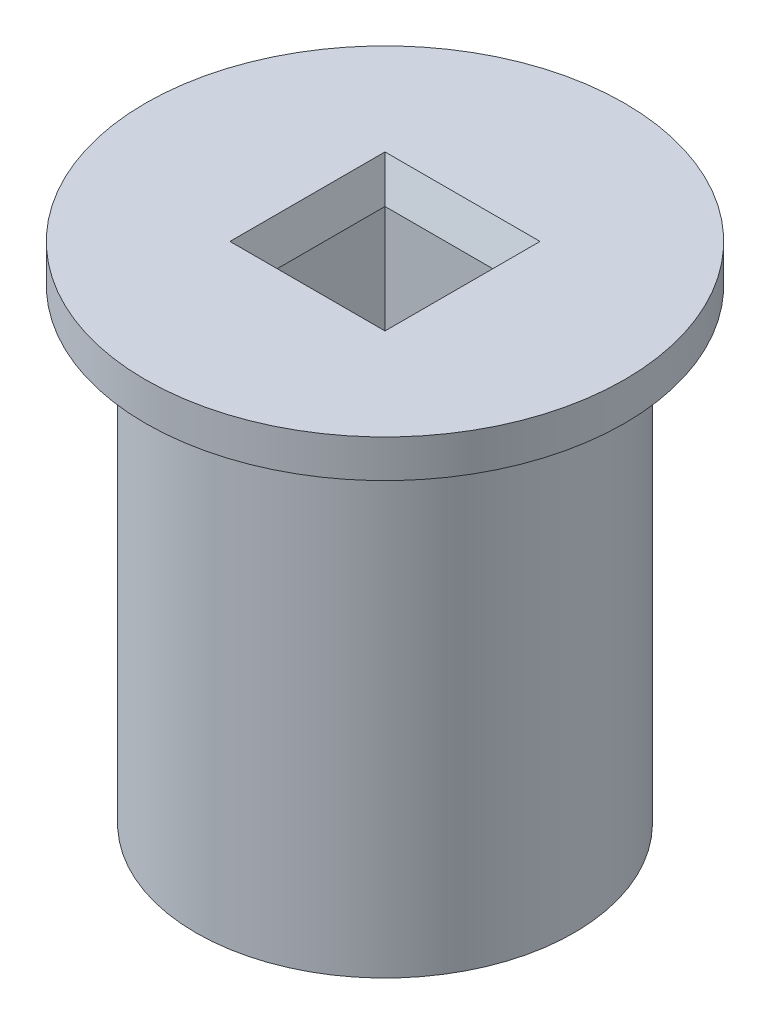
ISO-10303-21;
HEADER;
FILE_DESCRIPTION(('STEP AP214'),'2;1');
FILE_NAME('part.step','',(''),(''),'','','');
FILE_SCHEMA(('AUTOMOTIVE_DESIGN { 1 0 10303 214 1 1 1 1 }'));
ENDSEC;
DATA;
#1=APPLICATION_CONTEXT('core data for automotive mechanical design processes');
#2=APPLICATION_PROTOCOL_DEFINITION('international standard','automotive_design',2000,#1);
#3=PRODUCT_CONTEXT('',#1,'mechanical');
#4=PRODUCT('Part','Part','',(#3));
#5=PRODUCT_RELATED_PRODUCT_CATEGORY('part','',(#4));
#6=PRODUCT_DEFINITION_FORMATION('','',#4);
#7=PRODUCT_DEFINITION_CONTEXT('part definition',#1,'design');
#8=PRODUCT_DEFINITION('design','',#6,#7);
#9=PRODUCT_DEFINITION_SHAPE('','',#8);
#10=(LENGTH_UNIT() NAMED_UNIT(*) SI_UNIT(.MILLI.,.METRE.));
#11=(NAMED_UNIT(*) PLANE_ANGLE_UNIT() SI_UNIT($,.RADIAN.));
#12=(NAMED_UNIT(*) SI_UNIT($,.STERADIAN.) SOLID_ANGLE_UNIT());
#13=UNCERTAINTY_MEASURE_WITH_UNIT(LENGTH_MEASURE(1.E-05),#10,'distance_accuracy_value','');
#14=(GEOMETRIC_REPRESENTATION_CONTEXT(3) GLOBAL_UNCERTAINTY_ASSIGNED_CONTEXT((#13)) GLOBAL_UNIT_ASSIGNED_CONTEXT((#10,
#11,#12)) REPRESENTATION_CONTEXT('',''));
#15=CARTESIAN_POINT('',(0.,0.,0.));
#16=DIRECTION('',(0.,0.,1.));
#17=DIRECTION('',(1.,0.,0.));
#18=AXIS2_PLACEMENT_3D('',#15,#16,#17);
#19=CARTESIAN_POINT('',(0.,40.,0.));
#20=DIRECTION('',(0.,-1.,0.));
#21=DIRECTION('',(0.,0.,-1.));
#22=AXIS2_PLACEMENT_3D('',#19,#20,#21);
#23=CYLINDRICAL_SURFACE('',#22,15.);
#24=CARTESIAN_POINT('',(0.,0.,0.));
#25=DIRECTION('',(0.,1.,0.));
#26=DIRECTION('',(0.,0.,1.));
#27=AXIS2_PLACEMENT_3D('',#24,#25,#26);
#28=CIRCLE('',#27,15.);
#29=CARTESIAN_POINT('',(0.,0.,15.));
#30=VERTEX_POINT('',#29);
#31=EDGE_CURVE('E92',#30,#30,#28,.T.);
#32=ORIENTED_EDGE('',*,*,#31,.T.);
#33=EDGE_LOOP('',(#32));
#34=FACE_BOUND('',#33,.T.);
#35=CARTESIAN_POINT('',(0.,37.,0.));
#36=DIRECTION('',(0.,1.,0.));
#37=DIRECTION('',(0.,0.,1.));
#38=AXIS2_PLACEMENT_3D('',#35,#36,#37);
#39=CIRCLE('',#38,15.);
#40=CARTESIAN_POINT('',(0.,37.,15.));
#41=VERTEX_POINT('',#40);
#42=EDGE_CURVE('E113',#41,#41,#39,.T.);
#43=ORIENTED_EDGE('',*,*,#42,.F.);
#44=EDGE_LOOP('',(#43));
#45=FACE_BOUND('',#44,.T.);
#46=ADVANCED_FACE('F33',(#34,#45),#23,.T.);
#47=CARTESIAN_POINT('',(0.,40.,0.));
#48=DIRECTION('',(0.,1.,0.));
#49=DIRECTION('',(0.,0.,1.));
#50=AXIS2_PLACEMENT_3D('',#47,#48,#49);
#51=PLANE('',#50);
#52=DIRECTION('',(1.,0.,0.));
#53=VECTOR('',#52,1.);
#54=CARTESIAN_POINT('',(0.,40.,-6.15000000000001));
#55=LINE('',#54,#53);
#56=CARTESIAN_POINT('',(-6.15000000000001,40.,-6.15000000000001));
#57=VERTEX_POINT('',#56);
#58=CARTESIAN_POINT('',(6.15000000000001,40.,-6.15000000000001));
#59=VERTEX_POINT('',#58);
#60=EDGE_CURVE('E128',#57,#59,#55,.T.);
#61=ORIENTED_EDGE('',*,*,#60,.T.);
#62=DIRECTION('',(0.,0.,1.));
#63=VECTOR('',#62,1.);
#64=CARTESIAN_POINT('',(6.15000000000001,40.,0.));
#65=LINE('',#64,#63);
#66=CARTESIAN_POINT('',(6.15000000000001,40.,6.15000000000001));
#67=VERTEX_POINT('',#66);
#68=EDGE_CURVE('E134',#59,#67,#65,.T.);
#69=ORIENTED_EDGE('',*,*,#68,.T.);
#70=DIRECTION('',(-1.,0.,0.));
#71=VECTOR('',#70,1.);
#72=CARTESIAN_POINT('',(0.,40.,6.15000000000001));
#73=LINE('',#72,#71);
#74=CARTESIAN_POINT('',(-6.15000000000001,40.,6.15000000000001));
#75=VERTEX_POINT('',#74);
#76=EDGE_CURVE('E132',#67,#75,#73,.T.);
#77=ORIENTED_EDGE('',*,*,#76,.T.);
#78=DIRECTION('',(0.,0.,-1.));
#79=VECTOR('',#78,1.);
#80=CARTESIAN_POINT('',(-6.15000000000001,40.,0.));
#81=LINE('',#80,#79);
#82=EDGE_CURVE('E130',#75,#57,#81,.T.);
#83=ORIENTED_EDGE('',*,*,#82,.T.);
#84=EDGE_LOOP('',(#61,#69,#77,#83));
#85=FACE_BOUND('',#84,.T.);
#86=CARTESIAN_POINT('',(0.,40.,0.));
#87=DIRECTION('',(0.,1.,0.));
#88=DIRECTION('',(0.,0.,1.));
#89=AXIS2_PLACEMENT_3D('',#86,#87,#88);
#90=CIRCLE('',#89,19.);
#91=CARTESIAN_POINT('',(0.,40.,19.));
#92=VERTEX_POINT('',#91);
#93=EDGE_CURVE('E110',#92,#92,#90,.T.);
#94=ORIENTED_EDGE('',*,*,#93,.T.);
#95=EDGE_LOOP('',(#94));
#96=FACE_BOUND('',#95,.T.);
#97=ADVANCED_FACE('F155',(#85,#96),#51,.T.);
#98=CARTESIAN_POINT('',(0.,0.,0.));
#99=DIRECTION('',(0.,1.,0.));
#100=DIRECTION('',(0.,0.,1.));
#101=AXIS2_PLACEMENT_3D('',#98,#99,#100);
#102=PLANE('',#101);
#103=ORIENTED_EDGE('',*,*,#31,.F.);
#104=EDGE_LOOP('',(#103));
#105=FACE_BOUND('',#104,.T.);
#106=DIRECTION('',(0.,0.,1.));
#107=VECTOR('',#106,1.);
#108=CARTESIAN_POINT('',(-5.15,0.,5.15));
#109=LINE('',#108,#107);
#110=CARTESIAN_POINT('',(-5.15,0.,-5.15));
#111=VERTEX_POINT('',#110);
#112=CARTESIAN_POINT('',(-5.15,0.,5.15));
#113=VERTEX_POINT('',#112);
#114=EDGE_CURVE('E88',#111,#113,#109,.T.);
#115=ORIENTED_EDGE('',*,*,#114,.T.);
#116=DIRECTION('',(1.,0.,0.));
#117=VECTOR('',#116,1.);
#118=CARTESIAN_POINT('',(5.15,0.,5.15));
#119=LINE('',#118,#117);
#120=CARTESIAN_POINT('',(5.15,0.,5.15));
#121=VERTEX_POINT('',#120);
#122=EDGE_CURVE('E96',#113,#121,#119,.T.);
#123=ORIENTED_EDGE('',*,*,#122,.T.);
#124=DIRECTION('',(0.,0.,-1.));
#125=VECTOR('',#124,1.);
#126=CARTESIAN_POINT('',(5.15,0.,5.15));
#127=LINE('',#126,#125);
#128=CARTESIAN_POINT('',(5.15,0.,-5.15));
#129=VERTEX_POINT('',#128);
#130=EDGE_CURVE('E102',#121,#129,#127,.T.);
#131=ORIENTED_EDGE('',*,*,#130,.T.);
#132=DIRECTION('',(-1.,0.,0.));
#133=VECTOR('',#132,1.);
#134=CARTESIAN_POINT('',(5.15,0.,-5.15));
#135=LINE('',#134,#133);
#136=EDGE_CURVE('E106',#129,#111,#135,.T.);
#137=ORIENTED_EDGE('',*,*,#136,.T.);
#138=EDGE_LOOP('',(#115,#123,#131,#137));
#139=FACE_BOUND('',#138,.T.);
#140=ADVANCED_FACE('F104',(#105,#139),#102,.F.);
#141=CARTESIAN_POINT('',(-5.15,40.,5.15));
#142=DIRECTION('',(1.,0.,0.));
#143=DIRECTION('',(0.,0.,-1.));
#144=AXIS2_PLACEMENT_3D('',#141,#142,#143);
#145=PLANE('',#144);
#146=DIRECTION('',(0.,-1.,0.));
#147=VECTOR('',#146,1.);
#148=CARTESIAN_POINT('',(-5.15,40.,-5.15));
#149=LINE('',#148,#147);
#150=CARTESIAN_POINT('',(-5.15,37.2525225805454,-5.15));
#151=VERTEX_POINT('',#150);
#152=EDGE_CURVE('E118',#151,#111,#149,.T.);
#153=ORIENTED_EDGE('',*,*,#152,.F.);
#154=DIRECTION('',(0.,0.,1.));
#155=VECTOR('',#154,1.);
#156=CARTESIAN_POINT('',(-5.15,37.2525225805454,5.15));
#157=LINE('',#156,#155);
#158=CARTESIAN_POINT('',(-5.15,37.2525225805454,5.15));
#159=VERTEX_POINT('',#158);
#160=EDGE_CURVE('E42',#151,#159,#157,.T.);
#161=ORIENTED_EDGE('',*,*,#160,.T.);
#162=DIRECTION('',(0.,-1.,0.));
#163=VECTOR('',#162,1.);
#164=CARTESIAN_POINT('',(-5.15,40.,5.15));
#165=LINE('',#164,#163);
#166=EDGE_CURVE('E84',#159,#113,#165,.T.);
#167=ORIENTED_EDGE('',*,*,#166,.T.);
#168=ORIENTED_EDGE('',*,*,#114,.F.);
#169=EDGE_LOOP('',(#153,#161,#167,#168));
#170=FACE_BOUND('',#169,.T.);
#171=ADVANCED_FACE('F86',(#170),#145,.T.);
#172=CARTESIAN_POINT('',(5.15,40.,5.15));
#173=DIRECTION('',(0.,0.,-1.));
#174=DIRECTION('',(-1.,0.,0.));
#175=AXIS2_PLACEMENT_3D('',#172,#173,#174);
#176=PLANE('',#175);
#177=ORIENTED_EDGE('',*,*,#166,.F.);
#178=DIRECTION('',(1.,0.,0.));
#179=VECTOR('',#178,1.);
#180=CARTESIAN_POINT('',(5.15,37.2525225805454,5.15));
#181=LINE('',#180,#179);
#182=CARTESIAN_POINT('',(5.15,37.2525225805454,5.15));
#183=VERTEX_POINT('',#182);
#184=EDGE_CURVE('E137',#159,#183,#181,.T.);
#185=ORIENTED_EDGE('',*,*,#184,.T.);
#186=DIRECTION('',(0.,-1.,0.));
#187=VECTOR('',#186,1.);
#188=CARTESIAN_POINT('',(5.15,40.,5.15));
#189=LINE('',#188,#187);
#190=EDGE_CURVE('E93',#183,#121,#189,.T.);
#191=ORIENTED_EDGE('',*,*,#190,.T.);
#192=ORIENTED_EDGE('',*,*,#122,.F.);
#193=EDGE_LOOP('',(#177,#185,#191,#192));
#194=FACE_BOUND('',#193,.T.);
#195=ADVANCED_FACE('F97',(#194),#176,.T.);
#196=CARTESIAN_POINT('',(5.15,40.,5.15));
#197=DIRECTION('',(-1.,0.,0.));
#198=DIRECTION('',(0.,0.,1.));
#199=AXIS2_PLACEMENT_3D('',#196,#197,#198);
#200=PLANE('',#199);
#201=ORIENTED_EDGE('',*,*,#190,.F.);
#202=DIRECTION('',(0.,0.,-1.));
#203=VECTOR('',#202,1.);
#204=CARTESIAN_POINT('',(5.15,37.2525225805454,5.15));
#205=LINE('',#204,#203);
#206=CARTESIAN_POINT('',(5.15,37.2525225805454,-5.15));
#207=VERTEX_POINT('',#206);
#208=EDGE_CURVE('E125',#183,#207,#205,.T.);
#209=ORIENTED_EDGE('',*,*,#208,.T.);
#210=DIRECTION('',(0.,-1.,0.));
#211=VECTOR('',#210,1.);
#212=CARTESIAN_POINT('',(5.15,40.,-5.15));
#213=LINE('',#212,#211);
#214=EDGE_CURVE('E120',#207,#129,#213,.T.);
#215=ORIENTED_EDGE('',*,*,#214,.T.);
#216=ORIENTED_EDGE('',*,*,#130,.F.);
#217=EDGE_LOOP('',(#201,#209,#215,#216));
#218=FACE_BOUND('',#217,.T.);
#219=ADVANCED_FACE('F244',(#218),#200,.T.);
#220=CARTESIAN_POINT('',(5.15,40.,-5.15));
#221=DIRECTION('',(0.,0.,1.));
#222=DIRECTION('',(1.,0.,0.));
#223=AXIS2_PLACEMENT_3D('',#220,#221,#222);
#224=PLANE('',#223);
#225=ORIENTED_EDGE('',*,*,#214,.F.);
#226=DIRECTION('',(-1.,0.,0.));
#227=VECTOR('',#226,1.);
#228=CARTESIAN_POINT('',(5.15,37.2525225805454,-5.15));
#229=LINE('',#228,#227);
#230=EDGE_CURVE('E11',#207,#151,#229,.T.);
#231=ORIENTED_EDGE('',*,*,#230,.T.);
#232=ORIENTED_EDGE('',*,*,#152,.T.);
#233=ORIENTED_EDGE('',*,*,#136,.F.);
#234=EDGE_LOOP('',(#225,#231,#232,#233));
#235=FACE_BOUND('',#234,.T.);
#236=ADVANCED_FACE('F168',(#235),#224,.T.);
#237=CARTESIAN_POINT('',(0.,37.,0.));
#238=DIRECTION('',(0.,1.,0.));
#239=DIRECTION('',(0.,0.,1.));
#240=AXIS2_PLACEMENT_3D('',#237,#238,#239);
#241=PLANE('',#240);
#242=CARTESIAN_POINT('',(0.,37.,0.));
#243=DIRECTION('',(0.,1.,0.));
#244=DIRECTION('',(0.,0.,1.));
#245=AXIS2_PLACEMENT_3D('',#242,#243,#244);
#246=CIRCLE('',#245,19.);
#247=CARTESIAN_POINT('',(0.,37.,19.));
#248=VERTEX_POINT('',#247);
#249=EDGE_CURVE('E107',#248,#248,#246,.T.);
#250=ORIENTED_EDGE('',*,*,#249,.F.);
#251=EDGE_LOOP('',(#250));
#252=FACE_BOUND('',#251,.T.);
#253=ORIENTED_EDGE('',*,*,#42,.T.);
#254=EDGE_LOOP('',(#253));
#255=FACE_BOUND('',#254,.T.);
#256=ADVANCED_FACE('F159',(#252,#255),#241,.F.);
#257=CARTESIAN_POINT('',(0.,37.,0.));
#258=DIRECTION('',(0.,1.,0.));
#259=DIRECTION('',(0.,0.,1.));
#260=AXIS2_PLACEMENT_3D('',#257,#258,#259);
#261=CYLINDRICAL_SURFACE('',#260,19.);
#262=ORIENTED_EDGE('',*,*,#249,.T.);
#263=EDGE_LOOP('',(#262));
#264=FACE_BOUND('',#263,.T.);
#265=ORIENTED_EDGE('',*,*,#93,.F.);
#266=EDGE_LOOP('',(#265));
#267=FACE_BOUND('',#266,.T.);
#268=ADVANCED_FACE('F157',(#264,#267),#261,.T.);
#269=CARTESIAN_POINT('',(-5.15,37.2525225805454,5.15));
#270=DIRECTION('',(-0.939692620785907,-0.342020143325673,0.));
#271=DIRECTION('',(0.,0.,1.));
#272=AXIS2_PLACEMENT_3D('',#269,#270,#271);
#273=PLANE('',#272);
#274=DIRECTION('',(0.323615577118188,-0.889126490715986,0.323615577118188));
#275=VECTOR('',#274,1.);
#276=CARTESIAN_POINT('',(-4.07131146993856,34.2888502015769,-4.07131146993856));
#277=LINE('',#276,#275);
#278=EDGE_CURVE('E143',#57,#151,#277,.T.);
#279=ORIENTED_EDGE('',*,*,#278,.F.);
#280=ORIENTED_EDGE('',*,*,#82,.F.);
#281=DIRECTION('',(0.323615577118188,-0.889126490715986,-0.323615577118188));
#282=VECTOR('',#281,1.);
#283=CARTESIAN_POINT('',(-4.07131146993856,34.2888502015769,4.07131146993856));
#284=LINE('',#283,#282);
#285=EDGE_CURVE('E37',#159,#75,#284,.F.);
#286=ORIENTED_EDGE('',*,*,#285,.F.);
#287=ORIENTED_EDGE('',*,*,#160,.F.);
#288=EDGE_LOOP('',(#279,#280,#286,#287));
#289=FACE_BOUND('',#288,.T.);
#290=ADVANCED_FACE('F35',(#289),#273,.F.);
#291=CARTESIAN_POINT('',(5.15,37.2525225805454,5.15));
#292=DIRECTION('',(0.,-0.342020143325673,0.939692620785907));
#293=DIRECTION('',(1.,0.,0.));
#294=AXIS2_PLACEMENT_3D('',#291,#292,#293);
#295=PLANE('',#294);
#296=ORIENTED_EDGE('',*,*,#285,.T.);
#297=ORIENTED_EDGE('',*,*,#76,.F.);
#298=DIRECTION('',(-0.323615577118188,-0.889126490715986,-0.323615577118188));
#299=VECTOR('',#298,1.);
#300=CARTESIAN_POINT('',(5.15,37.2525225805454,5.15));
#301=LINE('',#300,#299);
#302=EDGE_CURVE('E142',#183,#67,#301,.F.);
#303=ORIENTED_EDGE('',*,*,#302,.F.);
#304=ORIENTED_EDGE('',*,*,#184,.F.);
#305=EDGE_LOOP('',(#296,#297,#303,#304));
#306=FACE_BOUND('',#305,.T.);
#307=ADVANCED_FACE('F166',(#306),#295,.F.);
#308=CARTESIAN_POINT('',(5.15,37.2525225805454,-5.15));
#309=DIRECTION('',(0.,-0.342020143325673,-0.939692620785907));
#310=DIRECTION('',(-1.,0.,0.));
#311=AXIS2_PLACEMENT_3D('',#308,#309,#310);
#312=PLANE('',#311);
#313=ORIENTED_EDGE('',*,*,#278,.T.);
#314=ORIENTED_EDGE('',*,*,#230,.F.);
#315=DIRECTION('',(0.323615577118188,0.889126490715986,-0.323615577118188));
#316=VECTOR('',#315,1.);
#317=CARTESIAN_POINT('',(4.07131146993856,34.2888502015769,-4.07131146993856));
#318=LINE('',#317,#316);
#319=EDGE_CURVE('E140',#59,#207,#318,.F.);
#320=ORIENTED_EDGE('',*,*,#319,.F.);
#321=ORIENTED_EDGE('',*,*,#60,.F.);
#322=EDGE_LOOP('',(#313,#314,#320,#321));
#323=FACE_BOUND('',#322,.T.);
#324=ADVANCED_FACE('F186',(#323),#312,.F.);
#325=CARTESIAN_POINT('',(5.15,37.2525225805454,5.15));
#326=DIRECTION('',(0.939692620785907,-0.342020143325673,0.));
#327=DIRECTION('',(0.,0.,-1.));
#328=AXIS2_PLACEMENT_3D('',#325,#326,#327);
#329=PLANE('',#328);
#330=ORIENTED_EDGE('',*,*,#302,.T.);
#331=ORIENTED_EDGE('',*,*,#68,.F.);
#332=ORIENTED_EDGE('',*,*,#319,.T.);
#333=ORIENTED_EDGE('',*,*,#208,.F.);
#334=EDGE_LOOP('',(#330,#331,#332,#333));
#335=FACE_BOUND('',#334,.T.);
#336=ADVANCED_FACE('F183',(#335),#329,.F.);
#337=CLOSED_SHELL('',(#46,#97,#140,#171,#195,#219,#236,#256,#268,#290,#307,#324,#336));
#338=MANIFOLD_SOLID_BREP('B2',#337);
#339=ADVANCED_BREP_SHAPE_REPRESENTATION('',(#18,#338),#14);
#340=SHAPE_DEFINITION_REPRESENTATION(#9,#339);
ENDSEC;
END-ISO-10303-21;
